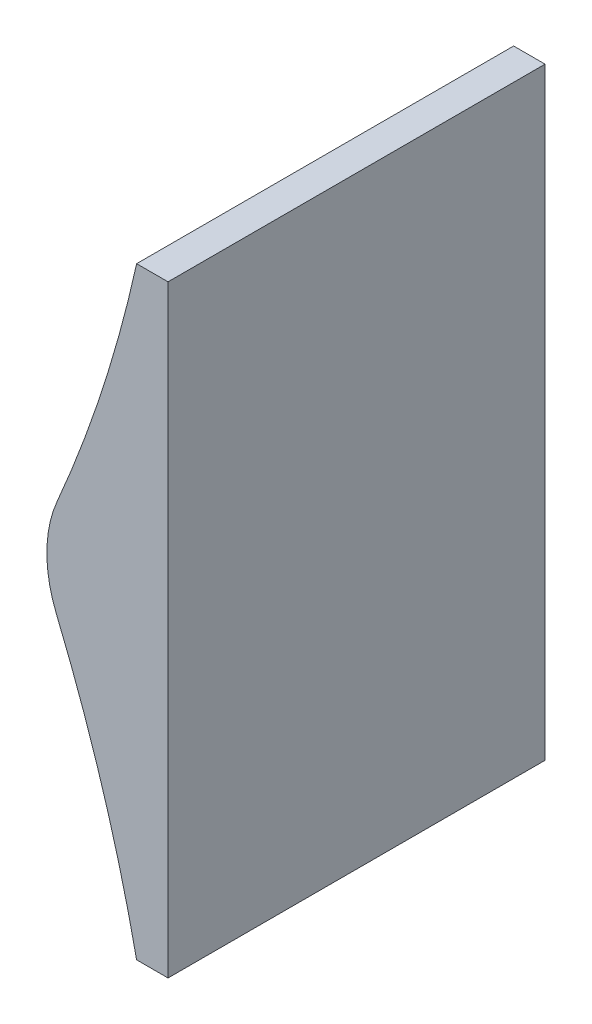
ISO-10303-21;
HEADER;
FILE_DESCRIPTION(('STEP AP214'),'2;1');
FILE_NAME('part.step','',(''),(''),'','','');
FILE_SCHEMA(('AUTOMOTIVE_DESIGN { 1 0 10303 214 1 1 1 1 }'));
ENDSEC;
DATA;
#1=APPLICATION_CONTEXT('core data for automotive mechanical design processes');
#2=APPLICATION_PROTOCOL_DEFINITION('international standard','automotive_design',2000,#1);
#3=PRODUCT_CONTEXT('',#1,'mechanical');
#4=PRODUCT('Part','Part','',(#3));
#5=PRODUCT_RELATED_PRODUCT_CATEGORY('part','',(#4));
#6=PRODUCT_DEFINITION_FORMATION('','',#4);
#7=PRODUCT_DEFINITION_CONTEXT('part definition',#1,'design');
#8=PRODUCT_DEFINITION('design','',#6,#7);
#9=PRODUCT_DEFINITION_SHAPE('','',#8);
#10=(LENGTH_UNIT() NAMED_UNIT(*) SI_UNIT(.MILLI.,.METRE.));
#11=(NAMED_UNIT(*) PLANE_ANGLE_UNIT() SI_UNIT($,.RADIAN.));
#12=(NAMED_UNIT(*) SI_UNIT($,.STERADIAN.) SOLID_ANGLE_UNIT());
#13=UNCERTAINTY_MEASURE_WITH_UNIT(LENGTH_MEASURE(1.E-05),#10,'distance_accuracy_value','');
#14=(GEOMETRIC_REPRESENTATION_CONTEXT(3) GLOBAL_UNCERTAINTY_ASSIGNED_CONTEXT((#13)) GLOBAL_UNIT_ASSIGNED_CONTEXT((#10,
#11,#12)) REPRESENTATION_CONTEXT('',''));
#15=CARTESIAN_POINT('',(0.,0.,0.));
#16=DIRECTION('',(0.,0.,1.));
#17=DIRECTION('',(1.,0.,0.));
#18=AXIS2_PLACEMENT_3D('',#15,#16,#17);
#19=CARTESIAN_POINT('',(215.9,539.749999999999,38.1));
#20=DIRECTION('',(0.,0.,-1.));
#21=DIRECTION('',(-1.,0.,0.));
#22=AXIS2_PLACEMENT_3D('',#19,#20,#21);
#23=CYLINDRICAL_SURFACE('',#22,271.462499999999);
#24=CARTESIAN_POINT('',(215.9,539.749999999999,-38.1));
#25=DIRECTION('',(0.,0.,-1.));
#26=DIRECTION('',(-1.,0.,0.));
#27=AXIS2_PLACEMENT_3D('',#24,#25,#26);
#28=CIRCLE('',#27,271.462499999999);
#29=CARTESIAN_POINT('',(481.012499999999,481.37833521305,-38.1));
#30=VERTEX_POINT('',#29);
#31=CARTESIAN_POINT('',(464.967167576029,431.780398065455,-38.1));
#32=VERTEX_POINT('',#31);
#33=EDGE_CURVE('E118',#30,#32,#28,.T.);
#34=ORIENTED_EDGE('',*,*,#33,.T.);
#35=DIRECTION('',(0.,0.,-1.));
#36=VECTOR('',#35,1.);
#37=CARTESIAN_POINT('',(464.967167576029,431.780398065455,38.1));
#38=LINE('',#37,#36);
#39=CARTESIAN_POINT('',(464.967167576029,431.780398065455,38.1));
#40=VERTEX_POINT('',#39);
#41=EDGE_CURVE('E11',#40,#32,#38,.T.);
#42=ORIENTED_EDGE('',*,*,#41,.F.);
#43=CARTESIAN_POINT('',(215.9,539.749999999999,38.1));
#44=DIRECTION('',(0.,0.,-1.));
#45=DIRECTION('',(-1.,0.,0.));
#46=AXIS2_PLACEMENT_3D('',#43,#44,#45);
#47=CIRCLE('',#46,271.462499999999);
#48=CARTESIAN_POINT('',(481.012499999999,481.37833521305,38.1));
#49=VERTEX_POINT('',#48);
#50=EDGE_CURVE('E131',#49,#40,#47,.T.);
#51=ORIENTED_EDGE('',*,*,#50,.F.);
#52=DIRECTION('',(0.,0.,-1.));
#53=VECTOR('',#52,1.);
#54=CARTESIAN_POINT('',(481.012499999999,481.37833521305,38.1));
#55=LINE('',#54,#53);
#56=EDGE_CURVE('E114',#49,#30,#55,.T.);
#57=ORIENTED_EDGE('',*,*,#56,.T.);
#58=EDGE_LOOP('',(#34,#42,#51,#57));
#59=FACE_BOUND('',#58,.T.);
#60=ADVANCED_FACE('F36',(#59),#23,.F.);
#61=CARTESIAN_POINT('',(488.27169787554,421.677979170995,38.1));
#62=DIRECTION('',(0.,0.,-1.));
#63=DIRECTION('',(-1.,0.,0.));
#64=AXIS2_PLACEMENT_3D('',#61,#62,#63);
#65=CYLINDRICAL_SURFACE('',#64,25.4);
#66=CARTESIAN_POINT('',(488.27169787554,421.677979170995,-38.1));
#67=DIRECTION('',(0.,0.,1.));
#68=DIRECTION('',(1.,0.,0.));
#69=AXIS2_PLACEMENT_3D('',#66,#67,#68);
#70=CIRCLE('',#69,25.4);
#71=CARTESIAN_POINT('',(464.802007402591,411.965429088552,-38.1));
#72=VERTEX_POINT('',#71);
#73=EDGE_CURVE('E121',#32,#72,#70,.T.);
#74=ORIENTED_EDGE('',*,*,#73,.T.);
#75=DIRECTION('',(0.,0.,-1.));
#76=VECTOR('',#75,1.);
#77=CARTESIAN_POINT('',(464.802007402591,411.965429088552,38.1));
#78=LINE('',#77,#76);
#79=CARTESIAN_POINT('',(464.802007402591,411.965429088552,38.1));
#80=VERTEX_POINT('',#79);
#81=EDGE_CURVE('E44',#80,#72,#78,.T.);
#82=ORIENTED_EDGE('',*,*,#81,.F.);
#83=CARTESIAN_POINT('',(488.27169787554,421.677979170995,38.1));
#84=DIRECTION('',(0.,0.,1.));
#85=DIRECTION('',(1.,0.,0.));
#86=AXIS2_PLACEMENT_3D('',#83,#84,#85);
#87=CIRCLE('',#86,25.4);
#88=EDGE_CURVE('E85',#40,#80,#87,.T.);
#89=ORIENTED_EDGE('',*,*,#88,.F.);
#90=ORIENTED_EDGE('',*,*,#41,.T.);
#91=EDGE_LOOP('',(#74,#82,#89,#90));
#92=FACE_BOUND('',#91,.T.);
#93=ADVANCED_FACE('F137',(#92),#65,.T.);
#94=CARTESIAN_POINT('',(190.5,298.449999999999,38.1));
#95=DIRECTION('',(0.,0.,-1.));
#96=DIRECTION('',(-1.,0.,0.));
#97=AXIS2_PLACEMENT_3D('',#94,#95,#96);
#98=CYLINDRICAL_SURFACE('',#97,296.862499999999);
#99=CARTESIAN_POINT('',(190.5,298.449999999999,-38.1));
#100=DIRECTION('',(0.,0.,1.));
#101=DIRECTION('',(1.,0.,0.));
#102=AXIS2_PLACEMENT_3D('',#99,#100,#101);
#103=CIRCLE('',#102,296.862499999999);
#104=CARTESIAN_POINT('',(481.012499999999,359.522344395805,-38.1));
#105=VERTEX_POINT('',#104);
#106=EDGE_CURVE('E124',#105,#72,#103,.T.);
#107=ORIENTED_EDGE('',*,*,#106,.F.);
#108=DIRECTION('',(0.,0.,-1.));
#109=VECTOR('',#108,1.);
#110=CARTESIAN_POINT('',(481.012499999999,359.522344395805,38.1));
#111=LINE('',#110,#109);
#112=CARTESIAN_POINT('',(481.012499999999,359.522344395805,38.1));
#113=VERTEX_POINT('',#112);
#114=EDGE_CURVE('E104',#113,#105,#111,.T.);
#115=ORIENTED_EDGE('',*,*,#114,.F.);
#116=CARTESIAN_POINT('',(190.5,298.449999999999,38.1));
#117=DIRECTION('',(0.,0.,1.));
#118=DIRECTION('',(1.,0.,0.));
#119=AXIS2_PLACEMENT_3D('',#116,#117,#118);
#120=CIRCLE('',#119,296.862499999999);
#121=EDGE_CURVE('E110',#113,#80,#120,.T.);
#122=ORIENTED_EDGE('',*,*,#121,.T.);
#123=ORIENTED_EDGE('',*,*,#81,.T.);
#124=EDGE_LOOP('',(#107,#115,#122,#123));
#125=FACE_BOUND('',#124,.T.);
#126=ADVANCED_FACE('F136',(#125),#98,.F.);
#127=CARTESIAN_POINT('',(487.362499999999,359.522344395805,38.1));
#128=DIRECTION('',(0.,-1.,0.));
#129=DIRECTION('',(0.,0.,-1.));
#130=AXIS2_PLACEMENT_3D('',#127,#128,#129);
#131=PLANE('',#130);
#132=DIRECTION('',(-1.,0.,0.));
#133=VECTOR('',#132,1.);
#134=CARTESIAN_POINT('',(487.362499999999,359.522344395805,-38.1));
#135=LINE('',#134,#133);
#136=CARTESIAN_POINT('',(487.362499999999,359.522344395805,-38.1));
#137=VERTEX_POINT('',#136);
#138=EDGE_CURVE('E99',#137,#105,#135,.T.);
#139=ORIENTED_EDGE('',*,*,#138,.F.);
#140=DIRECTION('',(0.,0.,-1.));
#141=VECTOR('',#140,1.);
#142=CARTESIAN_POINT('',(487.362499999999,359.522344395805,38.1));
#143=LINE('',#142,#141);
#144=CARTESIAN_POINT('',(487.362499999999,359.522344395805,38.1));
#145=VERTEX_POINT('',#144);
#146=EDGE_CURVE('E94',#145,#137,#143,.T.);
#147=ORIENTED_EDGE('',*,*,#146,.F.);
#148=DIRECTION('',(-1.,0.,0.));
#149=VECTOR('',#148,1.);
#150=CARTESIAN_POINT('',(487.362499999999,359.522344395805,38.1));
#151=LINE('',#150,#149);
#152=EDGE_CURVE('E97',#145,#113,#151,.T.);
#153=ORIENTED_EDGE('',*,*,#152,.T.);
#154=ORIENTED_EDGE('',*,*,#114,.T.);
#155=EDGE_LOOP('',(#139,#147,#153,#154));
#156=FACE_BOUND('',#155,.T.);
#157=ADVANCED_FACE('F96',(#156),#131,.T.);
#158=CARTESIAN_POINT('',(487.362499999999,481.37833521305,38.1));
#159=DIRECTION('',(1.,0.,0.));
#160=DIRECTION('',(0.,1.,0.));
#161=AXIS2_PLACEMENT_3D('',#158,#159,#160);
#162=PLANE('',#161);
#163=DIRECTION('',(0.,-1.,0.));
#164=VECTOR('',#163,1.);
#165=CARTESIAN_POINT('',(487.362499999999,481.37833521305,-38.1));
#166=LINE('',#165,#164);
#167=CARTESIAN_POINT('',(487.362499999999,481.37833521305,-38.1));
#168=VERTEX_POINT('',#167);
#169=EDGE_CURVE('E128',#168,#137,#166,.T.);
#170=ORIENTED_EDGE('',*,*,#169,.F.);
#171=DIRECTION('',(0.,0.,-1.));
#172=VECTOR('',#171,1.);
#173=CARTESIAN_POINT('',(487.362499999999,481.37833521305,38.1));
#174=LINE('',#173,#172);
#175=CARTESIAN_POINT('',(487.362499999999,481.37833521305,38.1));
#176=VERTEX_POINT('',#175);
#177=EDGE_CURVE('E74',#176,#168,#174,.T.);
#178=ORIENTED_EDGE('',*,*,#177,.F.);
#179=DIRECTION('',(0.,-1.,0.));
#180=VECTOR('',#179,1.);
#181=CARTESIAN_POINT('',(487.362499999999,481.37833521305,38.1));
#182=LINE('',#181,#180);
#183=EDGE_CURVE('E108',#176,#145,#182,.T.);
#184=ORIENTED_EDGE('',*,*,#183,.T.);
#185=ORIENTED_EDGE('',*,*,#146,.T.);
#186=EDGE_LOOP('',(#170,#178,#184,#185));
#187=FACE_BOUND('',#186,.T.);
#188=ADVANCED_FACE('F112',(#187),#162,.T.);
#189=CARTESIAN_POINT('',(487.362499999999,481.37833521305,38.1));
#190=DIRECTION('',(0.,-1.,0.));
#191=DIRECTION('',(0.,0.,-1.));
#192=AXIS2_PLACEMENT_3D('',#189,#190,#191);
#193=PLANE('',#192);
#194=DIRECTION('',(-1.,0.,0.));
#195=VECTOR('',#194,1.);
#196=CARTESIAN_POINT('',(487.362499999999,481.37833521305,-38.1));
#197=LINE('',#196,#195);
#198=EDGE_CURVE('E77',#168,#30,#197,.T.);
#199=ORIENTED_EDGE('',*,*,#198,.T.);
#200=ORIENTED_EDGE('',*,*,#56,.F.);
#201=DIRECTION('',(-1.,0.,0.));
#202=VECTOR('',#201,1.);
#203=CARTESIAN_POINT('',(487.362499999999,481.37833521305,38.1));
#204=LINE('',#203,#202);
#205=EDGE_CURVE('E52',#176,#49,#204,.T.);
#206=ORIENTED_EDGE('',*,*,#205,.F.);
#207=ORIENTED_EDGE('',*,*,#177,.T.);
#208=EDGE_LOOP('',(#199,#200,#206,#207));
#209=FACE_BOUND('',#208,.T.);
#210=ADVANCED_FACE('F144',(#209),#193,.F.);
#211=CARTESIAN_POINT('',(215.9,539.749999999999,38.1));
#212=DIRECTION('',(0.,0.,-1.));
#213=DIRECTION('',(-1.,0.,0.));
#214=AXIS2_PLACEMENT_3D('',#211,#212,#213);
#215=PLANE('',#214);
#216=ORIENTED_EDGE('',*,*,#50,.T.);
#217=ORIENTED_EDGE('',*,*,#88,.T.);
#218=ORIENTED_EDGE('',*,*,#121,.F.);
#219=ORIENTED_EDGE('',*,*,#152,.F.);
#220=ORIENTED_EDGE('',*,*,#183,.F.);
#221=ORIENTED_EDGE('',*,*,#205,.T.);
#222=EDGE_LOOP('',(#216,#217,#218,#219,#220,#221));
#223=FACE_BOUND('',#222,.T.);
#224=ADVANCED_FACE('F107',(#223),#215,.F.);
#225=CARTESIAN_POINT('',(215.9,539.749999999999,-38.1));
#226=DIRECTION('',(0.,0.,-1.));
#227=DIRECTION('',(-1.,0.,0.));
#228=AXIS2_PLACEMENT_3D('',#225,#226,#227);
#229=PLANE('',#228);
#230=ORIENTED_EDGE('',*,*,#33,.F.);
#231=ORIENTED_EDGE('',*,*,#198,.F.);
#232=ORIENTED_EDGE('',*,*,#169,.T.);
#233=ORIENTED_EDGE('',*,*,#138,.T.);
#234=ORIENTED_EDGE('',*,*,#106,.T.);
#235=ORIENTED_EDGE('',*,*,#73,.F.);
#236=EDGE_LOOP('',(#230,#231,#232,#233,#234,#235));
#237=FACE_BOUND('',#236,.T.);
#238=ADVANCED_FACE('F141',(#237),#229,.T.);
#239=CLOSED_SHELL('',(#60,#93,#126,#157,#188,#210,#224,#238));
#240=MANIFOLD_SOLID_BREP('B2',#239);
#241=ADVANCED_BREP_SHAPE_REPRESENTATION('',(#18,#240),#14);
#242=SHAPE_DEFINITION_REPRESENTATION(#9,#241);
ENDSEC;
END-ISO-10303-21;
